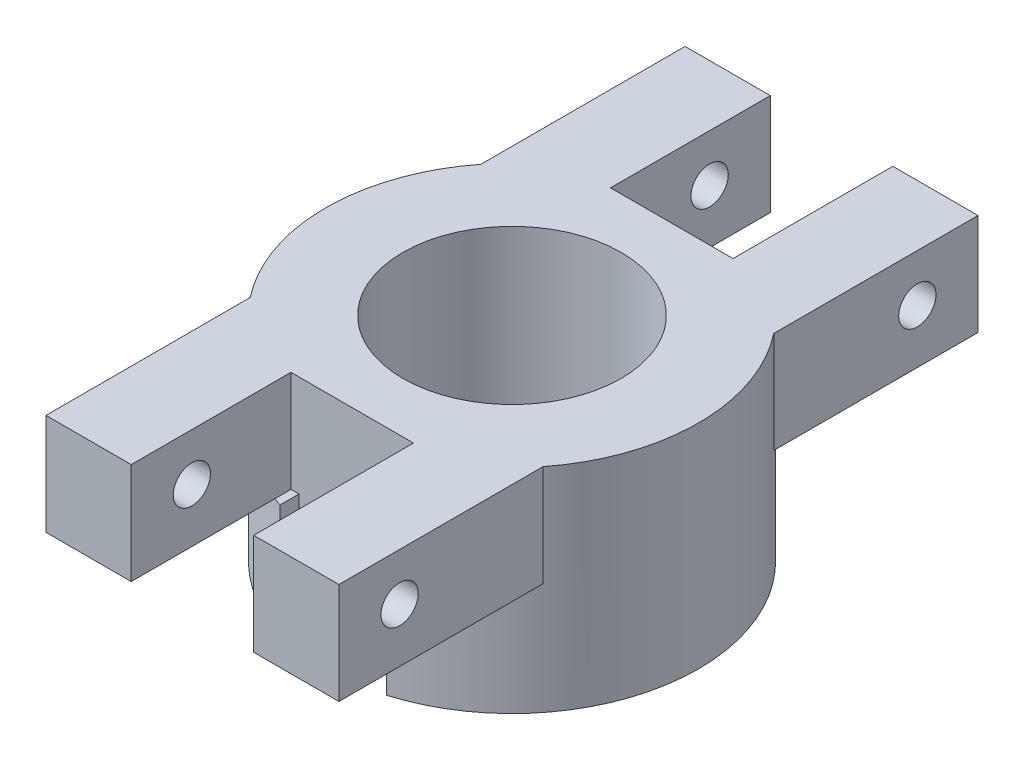
ISO-10303-21;
HEADER;
FILE_DESCRIPTION(('STEP AP214'),'2;1');
FILE_NAME('part.step','',(''),(''),'','','');
FILE_SCHEMA(('AUTOMOTIVE_DESIGN { 1 0 10303 214 1 1 1 1 }'));
ENDSEC;
DATA;
#1=APPLICATION_CONTEXT('core data for automotive mechanical design processes');
#2=APPLICATION_PROTOCOL_DEFINITION('international standard','automotive_design',2000,#1);
#3=PRODUCT_CONTEXT('',#1,'mechanical');
#4=PRODUCT('Part','Part','',(#3));
#5=PRODUCT_RELATED_PRODUCT_CATEGORY('part','',(#4));
#6=PRODUCT_DEFINITION_FORMATION('','',#4);
#7=PRODUCT_DEFINITION_CONTEXT('part definition',#1,'design');
#8=PRODUCT_DEFINITION('design','',#6,#7);
#9=PRODUCT_DEFINITION_SHAPE('','',#8);
#10=(LENGTH_UNIT() NAMED_UNIT(*) SI_UNIT(.MILLI.,.METRE.));
#11=(NAMED_UNIT(*) PLANE_ANGLE_UNIT() SI_UNIT($,.RADIAN.));
#12=(NAMED_UNIT(*) SI_UNIT($,.STERADIAN.) SOLID_ANGLE_UNIT());
#13=UNCERTAINTY_MEASURE_WITH_UNIT(LENGTH_MEASURE(1.E-05),#10,'distance_accuracy_value','');
#14=(GEOMETRIC_REPRESENTATION_CONTEXT(3) GLOBAL_UNCERTAINTY_ASSIGNED_CONTEXT((#13)) GLOBAL_UNIT_ASSIGNED_CONTEXT((#10,
#11,#12)) REPRESENTATION_CONTEXT('',''));
#15=CARTESIAN_POINT('',(0.,0.,0.));
#16=DIRECTION('',(0.,0.,1.));
#17=DIRECTION('',(1.,0.,0.));
#18=AXIS2_PLACEMENT_3D('',#15,#16,#17);
#19=CARTESIAN_POINT('',(0.,5.,0.));
#20=DIRECTION('',(0.,1.,0.));
#21=DIRECTION('',(0.,0.,1.));
#22=AXIS2_PLACEMENT_3D('',#19,#20,#21);
#23=PLANE('',#22);
#24=CARTESIAN_POINT('',(0.,5.,0.));
#25=DIRECTION('',(0.,1.,0.));
#26=DIRECTION('',(0.,0.,1.));
#27=AXIS2_PLACEMENT_3D('',#24,#25,#26);
#28=CIRCLE('',#27,4.1);
#29=CARTESIAN_POINT('',(0.,5.,4.1));
#30=VERTEX_POINT('',#29);
#31=EDGE_CURVE('E408',#30,#30,#28,.T.);
#32=ORIENTED_EDGE('',*,*,#31,.F.);
#33=EDGE_LOOP('',(#32));
#34=FACE_BOUND('',#33,.T.);
#35=DIRECTION('',(-1.,0.,0.));
#36=VECTOR('',#35,1.);
#37=CARTESIAN_POINT('',(-2.,5.,6.));
#38=LINE('',#37,#36);
#39=CARTESIAN_POINT('',(2.3,5.,6.));
#40=VERTEX_POINT('',#39);
#41=CARTESIAN_POINT('',(-2.3,5.,6.));
#42=VERTEX_POINT('',#41);
#43=EDGE_CURVE('E258',#40,#42,#38,.T.);
#44=ORIENTED_EDGE('',*,*,#43,.F.);
#45=DIRECTION('',(0.,0.,1.));
#46=VECTOR('',#45,1.);
#47=CARTESIAN_POINT('',(2.3,5.,6.));
#48=LINE('',#47,#46);
#49=CARTESIAN_POINT('',(2.3,5.,12.));
#50=VERTEX_POINT('',#49);
#51=EDGE_CURVE('E503',#40,#50,#48,.T.);
#52=ORIENTED_EDGE('',*,*,#51,.T.);
#53=DIRECTION('',(1.,0.,0.));
#54=VECTOR('',#53,1.);
#55=CARTESIAN_POINT('',(2.,5.,12.));
#56=LINE('',#55,#54);
#57=CARTESIAN_POINT('',(5.5,5.,12.));
#58=VERTEX_POINT('',#57);
#59=EDGE_CURVE('E296',#50,#58,#56,.T.);
#60=ORIENTED_EDGE('',*,*,#59,.T.);
#61=DIRECTION('',(0.,0.,1.));
#62=VECTOR('',#61,1.);
#63=CARTESIAN_POINT('',(5.5,5.,4.));
#64=LINE('',#63,#62);
#65=CARTESIAN_POINT('',(5.5,5.,4.33012701892219));
#66=VERTEX_POINT('',#65);
#67=EDGE_CURVE('E299',#66,#58,#64,.T.);
#68=ORIENTED_EDGE('',*,*,#67,.F.);
#69=CARTESIAN_POINT('',(0.,5.,0.));
#70=DIRECTION('',(0.,1.,0.));
#71=DIRECTION('',(0.,0.,1.));
#72=AXIS2_PLACEMENT_3D('',#69,#70,#71);
#73=CIRCLE('',#72,7.);
#74=CARTESIAN_POINT('',(5.5,5.,-4.33012701892219));
#75=VERTEX_POINT('',#74);
#76=EDGE_CURVE('E419',#66,#75,#73,.T.);
#77=ORIENTED_EDGE('',*,*,#76,.T.);
#78=DIRECTION('',(0.,0.,-1.));
#79=VECTOR('',#78,1.);
#80=CARTESIAN_POINT('',(5.5,5.,-4.));
#81=LINE('',#80,#79);
#82=CARTESIAN_POINT('',(5.5,5.,-12.));
#83=VERTEX_POINT('',#82);
#84=EDGE_CURVE('E393',#75,#83,#81,.T.);
#85=ORIENTED_EDGE('',*,*,#84,.T.);
#86=DIRECTION('',(1.,0.,0.));
#87=VECTOR('',#86,1.);
#88=CARTESIAN_POINT('',(2.,5.,-12.));
#89=LINE('',#88,#87);
#90=CARTESIAN_POINT('',(2.3,5.,-12.));
#91=VERTEX_POINT('',#90);
#92=EDGE_CURVE('E385',#91,#83,#89,.T.);
#93=ORIENTED_EDGE('',*,*,#92,.F.);
#94=DIRECTION('',(0.,0.,-1.));
#95=VECTOR('',#94,1.);
#96=CARTESIAN_POINT('',(2.3,5.,-6.));
#97=LINE('',#96,#95);
#98=CARTESIAN_POINT('',(2.3,5.,-6.));
#99=VERTEX_POINT('',#98);
#100=EDGE_CURVE('E373',#99,#91,#97,.T.);
#101=ORIENTED_EDGE('',*,*,#100,.F.);
#102=DIRECTION('',(1.,0.,0.));
#103=VECTOR('',#102,1.);
#104=CARTESIAN_POINT('',(2.,5.,-6.));
#105=LINE('',#104,#103);
#106=CARTESIAN_POINT('',(-2.3,5.,-6.));
#107=VERTEX_POINT('',#106);
#108=EDGE_CURVE('E364',#107,#99,#105,.T.);
#109=ORIENTED_EDGE('',*,*,#108,.F.);
#110=DIRECTION('',(0.,0.,-1.));
#111=VECTOR('',#110,1.);
#112=CARTESIAN_POINT('',(-2.3,5.,-6.));
#113=LINE('',#112,#111);
#114=CARTESIAN_POINT('',(-2.3,5.,-12.));
#115=VERTEX_POINT('',#114);
#116=EDGE_CURVE('E333',#107,#115,#113,.T.);
#117=ORIENTED_EDGE('',*,*,#116,.T.);
#118=DIRECTION('',(-1.,0.,0.));
#119=VECTOR('',#118,1.);
#120=CARTESIAN_POINT('',(-2.,5.,-12.));
#121=LINE('',#120,#119);
#122=CARTESIAN_POINT('',(-5.5,5.,-12.));
#123=VERTEX_POINT('',#122);
#124=EDGE_CURVE('E351',#115,#123,#121,.T.);
#125=ORIENTED_EDGE('',*,*,#124,.T.);
#126=DIRECTION('',(0.,0.,-1.));
#127=VECTOR('',#126,1.);
#128=CARTESIAN_POINT('',(-5.5,5.,-4.));
#129=LINE('',#128,#127);
#130=CARTESIAN_POINT('',(-5.5,5.,-4.33012701892219));
#131=VERTEX_POINT('',#130);
#132=EDGE_CURVE('E354',#131,#123,#129,.T.);
#133=ORIENTED_EDGE('',*,*,#132,.F.);
#134=CARTESIAN_POINT('',(-5.5,5.,4.33012701892219));
#135=VERTEX_POINT('',#134);
#136=EDGE_CURVE('E418',#131,#135,#73,.T.);
#137=ORIENTED_EDGE('',*,*,#136,.T.);
#138=DIRECTION('',(0.,0.,1.));
#139=VECTOR('',#138,1.);
#140=CARTESIAN_POINT('',(-5.5,5.,4.));
#141=LINE('',#140,#139);
#142=CARTESIAN_POINT('',(-5.5,5.,12.));
#143=VERTEX_POINT('',#142);
#144=EDGE_CURVE('E285',#135,#143,#141,.T.);
#145=ORIENTED_EDGE('',*,*,#144,.T.);
#146=DIRECTION('',(-1.,0.,0.));
#147=VECTOR('',#146,1.);
#148=CARTESIAN_POINT('',(-2.,5.,12.));
#149=LINE('',#148,#147);
#150=CARTESIAN_POINT('',(-2.3,5.,12.));
#151=VERTEX_POINT('',#150);
#152=EDGE_CURVE('E277',#151,#143,#149,.T.);
#153=ORIENTED_EDGE('',*,*,#152,.F.);
#154=DIRECTION('',(0.,0.,1.));
#155=VECTOR('',#154,1.);
#156=CARTESIAN_POINT('',(-2.3,5.,6.));
#157=LINE('',#156,#155);
#158=EDGE_CURVE('E53',#42,#151,#157,.T.);
#159=ORIENTED_EDGE('',*,*,#158,.F.);
#160=EDGE_LOOP('',(#44,#52,#60,#68,#77,#85,#93,#101,#109,#117,#125,#133,#137,#145,#153,#159));
#161=FACE_BOUND('',#160,.T.);
#162=ADVANCED_FACE('F36',(#34,#161),#23,.T.);
#163=CARTESIAN_POINT('',(2.,5.,4.));
#164=DIRECTION('',(1.,0.,0.));
#165=DIRECTION('',(0.,0.,-1.));
#166=AXIS2_PLACEMENT_3D('',#163,#164,#165);
#167=PLANE('',#166);
#168=DIRECTION('',(0.,0.,1.));
#169=VECTOR('',#168,1.);
#170=CARTESIAN_POINT('',(2.,1.19374248473036,6.));
#171=LINE('',#170,#169);
#172=CARTESIAN_POINT('',(2.,1.19374248473036,6.));
#173=VERTEX_POINT('',#172);
#174=CARTESIAN_POINT('',(2.,1.19374248473036,6.70820393249937));
#175=VERTEX_POINT('',#174);
#176=EDGE_CURVE('E215',#173,#175,#171,.T.);
#177=ORIENTED_EDGE('',*,*,#176,.F.);
#178=DIRECTION('',(0.,-1.,0.));
#179=VECTOR('',#178,1.);
#180=CARTESIAN_POINT('',(2.,5.,6.));
#181=LINE('',#180,#179);
#182=CARTESIAN_POINT('',(2.,-3.,6.));
#183=VERTEX_POINT('',#182);
#184=EDGE_CURVE('E228',#173,#183,#181,.T.);
#185=ORIENTED_EDGE('',*,*,#184,.T.);
#186=DIRECTION('',(0.,0.,1.));
#187=VECTOR('',#186,1.);
#188=CARTESIAN_POINT('',(2.,-3.,6.));
#189=LINE('',#188,#187);
#190=CARTESIAN_POINT('',(2.,-3.,6.70820393249937));
#191=VERTEX_POINT('',#190);
#192=EDGE_CURVE('E243',#183,#191,#189,.T.);
#193=ORIENTED_EDGE('',*,*,#192,.T.);
#194=DIRECTION('',(0.,1.,0.));
#195=VECTOR('',#194,1.);
#196=CARTESIAN_POINT('',(2.,-3.,6.70820393249937));
#197=LINE('',#196,#195);
#198=EDGE_CURVE('E231',#191,#175,#197,.T.);
#199=ORIENTED_EDGE('',*,*,#198,.T.);
#200=EDGE_LOOP('',(#177,#185,#193,#199));
#201=FACE_BOUND('',#200,.T.);
#202=ADVANCED_FACE('F227',(#201),#167,.F.);
#203=CARTESIAN_POINT('',(2.,1.19374248473036,4.));
#204=DIRECTION('',(0.,1.,0.));
#205=DIRECTION('',(-1.,0.,0.));
#206=AXIS2_PLACEMENT_3D('',#203,#204,#205);
#207=PLANE('',#206);
#208=DIRECTION('',(0.,0.,1.));
#209=VECTOR('',#208,1.);
#210=CARTESIAN_POINT('',(2.3,1.19374248473036,6.));
#211=LINE('',#210,#209);
#212=CARTESIAN_POINT('',(2.3,1.19374248473036,6.61135387042624));
#213=VERTEX_POINT('',#212);
#214=CARTESIAN_POINT('',(2.3,1.19374248473036,12.));
#215=VERTEX_POINT('',#214);
#216=EDGE_CURVE('E232',#213,#215,#211,.T.);
#217=ORIENTED_EDGE('',*,*,#216,.F.);
#218=CARTESIAN_POINT('',(0.,1.19374248473036,0.));
#219=DIRECTION('',(0.,1.,0.));
#220=DIRECTION('',(-1.,0.,0.));
#221=AXIS2_PLACEMENT_3D('',#218,#219,#220);
#222=CIRCLE('',#221,7.);
#223=CARTESIAN_POINT('',(5.5,1.19374248473036,4.33012701892219));
#224=VERTEX_POINT('',#223);
#225=EDGE_CURVE('E425',#224,#213,#222,.F.);
#226=ORIENTED_EDGE('',*,*,#225,.F.);
#227=DIRECTION('',(0.,0.,1.));
#228=VECTOR('',#227,1.);
#229=CARTESIAN_POINT('',(5.5,1.19374248473036,4.));
#230=LINE('',#229,#228);
#231=CARTESIAN_POINT('',(5.5,1.19374248473036,12.));
#232=VERTEX_POINT('',#231);
#233=EDGE_CURVE('E298',#224,#232,#230,.T.);
#234=ORIENTED_EDGE('',*,*,#233,.T.);
#235=DIRECTION('',(-1.,0.,0.));
#236=VECTOR('',#235,1.);
#237=CARTESIAN_POINT('',(2.,1.19374248473036,12.));
#238=LINE('',#237,#236);
#239=EDGE_CURVE('E288',#232,#215,#238,.T.);
#240=ORIENTED_EDGE('',*,*,#239,.T.);
#241=EDGE_LOOP('',(#217,#226,#234,#240));
#242=FACE_BOUND('',#241,.T.);
#243=ADVANCED_FACE('F546',(#242),#207,.F.);
#244=CARTESIAN_POINT('',(0.,0.,12.));
#245=DIRECTION('',(0.,0.,-1.));
#246=DIRECTION('',(1.,0.,0.));
#247=AXIS2_PLACEMENT_3D('',#244,#245,#246);
#248=PLANE('',#247);
#249=DIRECTION('',(0.,-1.,0.));
#250=VECTOR('',#249,1.);
#251=CARTESIAN_POINT('',(2.3,5.,12.));
#252=LINE('',#251,#250);
#253=EDGE_CURVE('E223',#50,#215,#252,.T.);
#254=ORIENTED_EDGE('',*,*,#253,.T.);
#255=ORIENTED_EDGE('',*,*,#239,.F.);
#256=DIRECTION('',(0.,-1.,0.));
#257=VECTOR('',#256,1.);
#258=CARTESIAN_POINT('',(5.5,5.,12.));
#259=LINE('',#258,#257);
#260=EDGE_CURVE('E293',#58,#232,#259,.T.);
#261=ORIENTED_EDGE('',*,*,#260,.F.);
#262=ORIENTED_EDGE('',*,*,#59,.F.);
#263=EDGE_LOOP('',(#254,#255,#261,#262));
#264=FACE_BOUND('',#263,.T.);
#265=ADVANCED_FACE('F514',(#264),#248,.F.);
#266=CARTESIAN_POINT('',(-7.,3.21941169873696,9.72178091826237));
#267=DIRECTION('',(1.,0.,0.));
#268=DIRECTION('',(0.,1.,0.));
#269=AXIS2_PLACEMENT_3D('',#266,#267,#268);
#270=CYLINDRICAL_SURFACE('',#269,0.7);
#271=CARTESIAN_POINT('',(5.5,3.21941169873696,9.72178091826237));
#272=DIRECTION('',(-1.,0.,0.));
#273=DIRECTION('',(0.,1.,0.));
#274=AXIS2_PLACEMENT_3D('',#271,#272,#273);
#275=CIRCLE('',#274,0.7);
#276=CARTESIAN_POINT('',(5.5,3.91941169873696,9.72178091826237));
#277=VERTEX_POINT('',#276);
#278=EDGE_CURVE('E249',#277,#277,#275,.T.);
#279=ORIENTED_EDGE('',*,*,#278,.F.);
#280=EDGE_LOOP('',(#279));
#281=FACE_BOUND('',#280,.T.);
#282=CARTESIAN_POINT('',(2.3,3.21941169873696,9.72178091826237));
#283=DIRECTION('',(-1.,0.,0.));
#284=DIRECTION('',(0.,0.,1.));
#285=AXIS2_PLACEMENT_3D('',#282,#283,#284);
#286=CIRCLE('',#285,0.7);
#287=CARTESIAN_POINT('',(2.3,3.21941169873696,10.4217809182624));
#288=VERTEX_POINT('',#287);
#289=EDGE_CURVE('E40',#288,#288,#286,.T.);
#290=ORIENTED_EDGE('',*,*,#289,.T.);
#291=EDGE_LOOP('',(#290));
#292=FACE_BOUND('',#291,.T.);
#293=ADVANCED_FACE('F553',(#281,#292),#270,.F.);
#294=CARTESIAN_POINT('',(0.,-3.,0.));
#295=DIRECTION('',(0.,1.,0.));
#296=DIRECTION('',(0.,0.,1.));
#297=AXIS2_PLACEMENT_3D('',#294,#295,#296);
#298=PLANE('',#297);
#299=CARTESIAN_POINT('',(0.,-3.,0.));
#300=DIRECTION('',(0.,1.,0.));
#301=DIRECTION('',(0.,0.,1.));
#302=AXIS2_PLACEMENT_3D('',#299,#300,#301);
#303=CIRCLE('',#302,4.1);
#304=CARTESIAN_POINT('',(0.,-3.,4.1));
#305=VERTEX_POINT('',#304);
#306=EDGE_CURVE('E409',#305,#305,#303,.T.);
#307=ORIENTED_EDGE('',*,*,#306,.T.);
#308=EDGE_LOOP('',(#307));
#309=FACE_BOUND('',#308,.T.);
#310=ORIENTED_EDGE('',*,*,#192,.F.);
#311=DIRECTION('',(-1.,0.,0.));
#312=VECTOR('',#311,1.);
#313=CARTESIAN_POINT('',(2.,-3.,6.));
#314=LINE('',#313,#312);
#315=CARTESIAN_POINT('',(-2.,-3.,6.));
#316=VERTEX_POINT('',#315);
#317=EDGE_CURVE('E238',#183,#316,#314,.T.);
#318=ORIENTED_EDGE('',*,*,#317,.T.);
#319=DIRECTION('',(0.,0.,1.));
#320=VECTOR('',#319,1.);
#321=CARTESIAN_POINT('',(-2.,-3.,6.));
#322=LINE('',#321,#320);
#323=CARTESIAN_POINT('',(-2.,-3.,6.70820393249937));
#324=VERTEX_POINT('',#323);
#325=EDGE_CURVE('E240',#316,#324,#322,.T.);
#326=ORIENTED_EDGE('',*,*,#325,.T.);
#327=CARTESIAN_POINT('',(0.,-3.,0.));
#328=DIRECTION('',(0.,1.,0.));
#329=DIRECTION('',(0.,0.,1.));
#330=AXIS2_PLACEMENT_3D('',#327,#328,#329);
#331=CIRCLE('',#330,7.);
#332=CARTESIAN_POINT('',(-2.,-3.,-6.70820393249937));
#333=VERTEX_POINT('',#332);
#334=EDGE_CURVE('E421',#333,#324,#331,.T.);
#335=ORIENTED_EDGE('',*,*,#334,.F.);
#336=DIRECTION('',(0.,0.,-1.));
#337=VECTOR('',#336,1.);
#338=CARTESIAN_POINT('',(-2.,-3.,-6.));
#339=LINE('',#338,#337);
#340=CARTESIAN_POINT('',(-2.,-3.,-6.));
#341=VERTEX_POINT('',#340);
#342=EDGE_CURVE('E310',#341,#333,#339,.T.);
#343=ORIENTED_EDGE('',*,*,#342,.F.);
#344=DIRECTION('',(-1.,0.,0.));
#345=VECTOR('',#344,1.);
#346=CARTESIAN_POINT('',(2.,-3.,-6.));
#347=LINE('',#346,#345);
#348=CARTESIAN_POINT('',(2.,-3.,-6.));
#349=VERTEX_POINT('',#348);
#350=EDGE_CURVE('E305',#349,#341,#347,.T.);
#351=ORIENTED_EDGE('',*,*,#350,.F.);
#352=DIRECTION('',(0.,0.,-1.));
#353=VECTOR('',#352,1.);
#354=CARTESIAN_POINT('',(2.,-3.,-6.));
#355=LINE('',#354,#353);
#356=CARTESIAN_POINT('',(2.,-3.,-6.70820393249937));
#357=VERTEX_POINT('',#356);
#358=EDGE_CURVE('E309',#349,#357,#355,.T.);
#359=ORIENTED_EDGE('',*,*,#358,.T.);
#360=EDGE_CURVE('E422',#191,#357,#331,.T.);
#361=ORIENTED_EDGE('',*,*,#360,.F.);
#362=EDGE_LOOP('',(#310,#318,#326,#335,#343,#351,#359,#361));
#363=FACE_BOUND('',#362,.T.);
#364=ADVANCED_FACE('F495',(#309,#363),#298,.F.);
#365=CARTESIAN_POINT('',(0.,-3.,0.));
#366=DIRECTION('',(0.,1.,0.));
#367=DIRECTION('',(0.,0.,1.));
#368=AXIS2_PLACEMENT_3D('',#365,#366,#367);
#369=CYLINDRICAL_SURFACE('',#368,7.);
#370=ORIENTED_EDGE('',*,*,#76,.F.);
#371=DIRECTION('',(0.,1.,0.));
#372=VECTOR('',#371,1.);
#373=CARTESIAN_POINT('',(5.5,-3.,4.33012701892219));
#374=LINE('',#373,#372);
#375=EDGE_CURVE('E61',#66,#224,#374,.F.);
#376=ORIENTED_EDGE('',*,*,#375,.T.);
#377=ORIENTED_EDGE('',*,*,#225,.T.);
#378=CARTESIAN_POINT('',(0.,1.19374248473036,0.));
#379=DIRECTION('',(0.,1.,0.));
#380=DIRECTION('',(0.,0.,1.));
#381=AXIS2_PLACEMENT_3D('',#378,#379,#380);
#382=CIRCLE('',#381,7.);
#383=EDGE_CURVE('E499',#213,#175,#382,.F.);
#384=ORIENTED_EDGE('',*,*,#383,.T.);
#385=ORIENTED_EDGE('',*,*,#198,.F.);
#386=ORIENTED_EDGE('',*,*,#360,.T.);
#387=DIRECTION('',(0.,-1.,0.));
#388=VECTOR('',#387,1.);
#389=CARTESIAN_POINT('',(2.,5.,-6.70820393249937));
#390=LINE('',#389,#388);
#391=CARTESIAN_POINT('',(2.,1.19374248473036,-6.70820393249937));
#392=VERTEX_POINT('',#391);
#393=EDGE_CURVE('E406',#392,#357,#390,.T.);
#394=ORIENTED_EDGE('',*,*,#393,.F.);
#395=CARTESIAN_POINT('',(0.,1.19374248473036,0.));
#396=DIRECTION('',(0.,-1.,0.));
#397=DIRECTION('',(0.,0.,-1.));
#398=AXIS2_PLACEMENT_3D('',#395,#396,#397);
#399=CIRCLE('',#398,7.);
#400=CARTESIAN_POINT('',(2.3,1.19374248473036,-6.61135387042624));
#401=VERTEX_POINT('',#400);
#402=EDGE_CURVE('E377',#401,#392,#399,.F.);
#403=ORIENTED_EDGE('',*,*,#402,.F.);
#404=CARTESIAN_POINT('',(0.,1.19374248473036,0.));
#405=DIRECTION('',(0.,-1.,0.));
#406=DIRECTION('',(1.,0.,0.));
#407=AXIS2_PLACEMENT_3D('',#404,#405,#406);
#408=CIRCLE('',#407,7.);
#409=CARTESIAN_POINT('',(5.5,1.19374248473036,-4.33012701892219));
#410=VERTEX_POINT('',#409);
#411=EDGE_CURVE('E396',#410,#401,#408,.F.);
#412=ORIENTED_EDGE('',*,*,#411,.F.);
#413=DIRECTION('',(0.,1.,0.));
#414=VECTOR('',#413,1.);
#415=CARTESIAN_POINT('',(5.5,-3.,-4.33012701892219));
#416=LINE('',#415,#414);
#417=EDGE_CURVE('E401',#75,#410,#416,.F.);
#418=ORIENTED_EDGE('',*,*,#417,.F.);
#419=EDGE_LOOP('',(#370,#376,#377,#384,#385,#386,#394,#403,#412,#418));
#420=FACE_BOUND('',#419,.T.);
#421=ADVANCED_FACE('F38',(#420),#369,.T.);
#422=CARTESIAN_POINT('',(-2.,1.19374248473036,-4.));
#423=DIRECTION('',(0.,1.,0.));
#424=DIRECTION('',(-1.,0.,0.));
#425=AXIS2_PLACEMENT_3D('',#422,#423,#424);
#426=PLANE('',#425);
#427=DIRECTION('',(0.,0.,-1.));
#428=VECTOR('',#427,1.);
#429=CARTESIAN_POINT('',(-2.3,1.19374248473036,-6.));
#430=LINE('',#429,#428);
#431=CARTESIAN_POINT('',(-2.3,1.19374248473036,-6.61135387042624));
#432=VERTEX_POINT('',#431);
#433=CARTESIAN_POINT('',(-2.3,1.19374248473036,-12.));
#434=VERTEX_POINT('',#433);
#435=EDGE_CURVE('E340',#432,#434,#430,.T.);
#436=ORIENTED_EDGE('',*,*,#435,.F.);
#437=CARTESIAN_POINT('',(0.,1.19374248473036,0.));
#438=DIRECTION('',(0.,1.,0.));
#439=DIRECTION('',(-1.,0.,0.));
#440=AXIS2_PLACEMENT_3D('',#437,#438,#439);
#441=CIRCLE('',#440,7.);
#442=CARTESIAN_POINT('',(-5.5,1.19374248473036,-4.33012701892219));
#443=VERTEX_POINT('',#442);
#444=EDGE_CURVE('E357',#443,#432,#441,.F.);
#445=ORIENTED_EDGE('',*,*,#444,.F.);
#446=DIRECTION('',(0.,0.,-1.));
#447=VECTOR('',#446,1.);
#448=CARTESIAN_POINT('',(-5.5,1.19374248473036,-4.));
#449=LINE('',#448,#447);
#450=CARTESIAN_POINT('',(-5.5,1.19374248473036,-12.));
#451=VERTEX_POINT('',#450);
#452=EDGE_CURVE('E353',#443,#451,#449,.T.);
#453=ORIENTED_EDGE('',*,*,#452,.T.);
#454=DIRECTION('',(1.,0.,0.));
#455=VECTOR('',#454,1.);
#456=CARTESIAN_POINT('',(-2.,1.19374248473036,-12.));
#457=LINE('',#456,#455);
#458=EDGE_CURVE('E345',#451,#434,#457,.T.);
#459=ORIENTED_EDGE('',*,*,#458,.T.);
#460=EDGE_LOOP('',(#436,#445,#453,#459));
#461=FACE_BOUND('',#460,.T.);
#462=ADVANCED_FACE('F473',(#461),#426,.F.);
#463=CARTESIAN_POINT('',(0.,0.,-12.));
#464=DIRECTION('',(0.,0.,1.));
#465=DIRECTION('',(-1.,0.,0.));
#466=AXIS2_PLACEMENT_3D('',#463,#464,#465);
#467=PLANE('',#466);
#468=DIRECTION('',(0.,-1.,0.));
#469=VECTOR('',#468,1.);
#470=CARTESIAN_POINT('',(-2.3,5.,-12.));
#471=LINE('',#470,#469);
#472=EDGE_CURVE('E324',#115,#434,#471,.T.);
#473=ORIENTED_EDGE('',*,*,#472,.T.);
#474=ORIENTED_EDGE('',*,*,#458,.F.);
#475=DIRECTION('',(0.,-1.,0.));
#476=VECTOR('',#475,1.);
#477=CARTESIAN_POINT('',(-5.5,5.,-12.));
#478=LINE('',#477,#476);
#479=EDGE_CURVE('E348',#123,#451,#478,.T.);
#480=ORIENTED_EDGE('',*,*,#479,.F.);
#481=ORIENTED_EDGE('',*,*,#124,.F.);
#482=EDGE_LOOP('',(#473,#474,#480,#481));
#483=FACE_BOUND('',#482,.T.);
#484=ADVANCED_FACE('F475',(#483),#467,.F.);
#485=CARTESIAN_POINT('',(0.,1.19374248473036,0.));
#486=DIRECTION('',(0.,-1.,0.));
#487=DIRECTION('',(1.,0.,0.));
#488=AXIS2_PLACEMENT_3D('',#485,#486,#487);
#489=CIRCLE('',#488,7.);
#490=CARTESIAN_POINT('',(-5.5,1.19374248473036,4.33012701892219));
#491=VERTEX_POINT('',#490);
#492=CARTESIAN_POINT('',(-2.3,1.19374248473036,6.61135387042624));
#493=VERTEX_POINT('',#492);
#494=EDGE_CURVE('E12',#491,#493,#489,.F.);
#495=ORIENTED_EDGE('',*,*,#494,.F.);
#496=DIRECTION('',(0.,1.,0.));
#497=VECTOR('',#496,1.);
#498=CARTESIAN_POINT('',(-5.5,-3.,4.33012701892219));
#499=LINE('',#498,#497);
#500=EDGE_CURVE('E45',#135,#491,#499,.F.);
#501=ORIENTED_EDGE('',*,*,#500,.F.);
#502=ORIENTED_EDGE('',*,*,#136,.F.);
#503=DIRECTION('',(0.,1.,0.));
#504=VECTOR('',#503,1.);
#505=CARTESIAN_POINT('',(-5.5,-3.,-4.33012701892219));
#506=LINE('',#505,#504);
#507=EDGE_CURVE('E361',#131,#443,#506,.F.);
#508=ORIENTED_EDGE('',*,*,#507,.T.);
#509=ORIENTED_EDGE('',*,*,#444,.T.);
#510=CARTESIAN_POINT('',(0.,1.19374248473036,0.));
#511=DIRECTION('',(0.,1.,0.));
#512=DIRECTION('',(0.,0.,1.));
#513=AXIS2_PLACEMENT_3D('',#510,#511,#512);
#514=CIRCLE('',#513,7.);
#515=CARTESIAN_POINT('',(-2.,1.19374248473036,-6.70820393249937));
#516=VERTEX_POINT('',#515);
#517=EDGE_CURVE('E336',#432,#516,#514,.F.);
#518=ORIENTED_EDGE('',*,*,#517,.T.);
#519=DIRECTION('',(0.,-1.,0.));
#520=VECTOR('',#519,1.);
#521=CARTESIAN_POINT('',(-2.,5.,-6.70820393249937));
#522=LINE('',#521,#520);
#523=EDGE_CURVE('E403',#516,#333,#522,.T.);
#524=ORIENTED_EDGE('',*,*,#523,.T.);
#525=ORIENTED_EDGE('',*,*,#334,.T.);
#526=DIRECTION('',(0.,1.,0.));
#527=VECTOR('',#526,1.);
#528=CARTESIAN_POINT('',(-2.,-3.,6.70820393249937));
#529=LINE('',#528,#527);
#530=CARTESIAN_POINT('',(-2.,1.19374248473036,6.70820393249937));
#531=VERTEX_POINT('',#530);
#532=EDGE_CURVE('E415',#324,#531,#529,.T.);
#533=ORIENTED_EDGE('',*,*,#532,.T.);
#534=CARTESIAN_POINT('',(0.,1.19374248473036,0.));
#535=DIRECTION('',(0.,-1.,0.));
#536=DIRECTION('',(0.,0.,-1.));
#537=AXIS2_PLACEMENT_3D('',#534,#535,#536);
#538=CIRCLE('',#537,7.);
#539=EDGE_CURVE('E269',#493,#531,#538,.F.);
#540=ORIENTED_EDGE('',*,*,#539,.F.);
#541=EDGE_LOOP('',(#495,#501,#502,#508,#509,#518,#524,#525,#533,#540));
#542=FACE_BOUND('',#541,.T.);
#543=ADVANCED_FACE('F454',(#542),#369,.T.);
#544=CARTESIAN_POINT('',(0.,-3.,0.));
#545=DIRECTION('',(0.,1.,0.));
#546=DIRECTION('',(0.,0.,1.));
#547=AXIS2_PLACEMENT_3D('',#544,#545,#546);
#548=CYLINDRICAL_SURFACE('',#547,4.1);
#549=ORIENTED_EDGE('',*,*,#31,.T.);
#550=EDGE_LOOP('',(#549));
#551=FACE_BOUND('',#550,.T.);
#552=ORIENTED_EDGE('',*,*,#306,.F.);
#553=EDGE_LOOP('',(#552));
#554=FACE_BOUND('',#553,.T.);
#555=ADVANCED_FACE('F564',(#551,#554),#548,.F.);
#556=CARTESIAN_POINT('',(2.,1.19374248473036,-4.));
#557=DIRECTION('',(0.,-1.,0.));
#558=DIRECTION('',(1.,0.,0.));
#559=AXIS2_PLACEMENT_3D('',#556,#557,#558);
#560=PLANE('',#559);
#561=DIRECTION('',(0.,0.,-1.));
#562=VECTOR('',#561,1.);
#563=CARTESIAN_POINT('',(2.3,1.19374248473036,-6.));
#564=LINE('',#563,#562);
#565=CARTESIAN_POINT('',(2.3,1.19374248473036,-12.));
#566=VERTEX_POINT('',#565);
#567=EDGE_CURVE('E381',#401,#566,#564,.T.);
#568=ORIENTED_EDGE('',*,*,#567,.T.);
#569=DIRECTION('',(-1.,0.,0.));
#570=VECTOR('',#569,1.);
#571=CARTESIAN_POINT('',(2.,1.19374248473036,-12.));
#572=LINE('',#571,#570);
#573=CARTESIAN_POINT('',(5.5,1.19374248473036,-12.));
#574=VERTEX_POINT('',#573);
#575=EDGE_CURVE('E390',#574,#566,#572,.T.);
#576=ORIENTED_EDGE('',*,*,#575,.F.);
#577=DIRECTION('',(0.,0.,-1.));
#578=VECTOR('',#577,1.);
#579=CARTESIAN_POINT('',(5.5,1.19374248473036,-4.));
#580=LINE('',#579,#578);
#581=EDGE_CURVE('E394',#410,#574,#580,.T.);
#582=ORIENTED_EDGE('',*,*,#581,.F.);
#583=ORIENTED_EDGE('',*,*,#411,.T.);
#584=EDGE_LOOP('',(#568,#576,#582,#583));
#585=FACE_BOUND('',#584,.T.);
#586=ADVANCED_FACE('F530',(#585),#560,.T.);
#587=CARTESIAN_POINT('',(5.5,5.,-4.));
#588=DIRECTION('',(1.,0.,0.));
#589=DIRECTION('',(0.,0.,-1.));
#590=AXIS2_PLACEMENT_3D('',#587,#588,#589);
#591=PLANE('',#590);
#592=CARTESIAN_POINT('',(5.5,3.21941169873696,-9.72178091826237));
#593=DIRECTION('',(1.,0.,0.));
#594=DIRECTION('',(0.,1.,0.));
#595=AXIS2_PLACEMENT_3D('',#592,#593,#594);
#596=CIRCLE('',#595,0.7);
#597=CARTESIAN_POINT('',(5.5,3.91941169873696,-9.72178091826237));
#598=VERTEX_POINT('',#597);
#599=EDGE_CURVE('E312',#598,#598,#596,.T.);
#600=ORIENTED_EDGE('',*,*,#599,.F.);
#601=EDGE_LOOP('',(#600));
#602=FACE_BOUND('',#601,.T.);
#603=ORIENTED_EDGE('',*,*,#84,.F.);
#604=ORIENTED_EDGE('',*,*,#417,.T.);
#605=ORIENTED_EDGE('',*,*,#581,.T.);
#606=DIRECTION('',(0.,-1.,0.));
#607=VECTOR('',#606,1.);
#608=CARTESIAN_POINT('',(5.5,5.,-12.));
#609=LINE('',#608,#607);
#610=EDGE_CURVE('E387',#83,#574,#609,.T.);
#611=ORIENTED_EDGE('',*,*,#610,.F.);
#612=EDGE_LOOP('',(#603,#604,#605,#611));
#613=FACE_BOUND('',#612,.T.);
#614=ADVANCED_FACE('F523',(#602,#613),#591,.T.);
#615=CARTESIAN_POINT('',(0.,0.,-12.));
#616=DIRECTION('',(0.,0.,1.));
#617=DIRECTION('',(1.,0.,0.));
#618=AXIS2_PLACEMENT_3D('',#615,#616,#617);
#619=PLANE('',#618);
#620=ORIENTED_EDGE('',*,*,#575,.T.);
#621=DIRECTION('',(0.,-1.,0.));
#622=VECTOR('',#621,1.);
#623=CARTESIAN_POINT('',(2.3,5.,-12.));
#624=LINE('',#623,#622);
#625=EDGE_CURVE('E363',#91,#566,#624,.T.);
#626=ORIENTED_EDGE('',*,*,#625,.F.);
#627=ORIENTED_EDGE('',*,*,#92,.T.);
#628=ORIENTED_EDGE('',*,*,#610,.T.);
#629=EDGE_LOOP('',(#620,#626,#627,#628));
#630=FACE_BOUND('',#629,.T.);
#631=ADVANCED_FACE('F533',(#630),#619,.F.);
#632=CARTESIAN_POINT('',(2.,1.19374248473036,-6.));
#633=DIRECTION('',(0.,-1.,0.));
#634=DIRECTION('',(0.,0.,-1.));
#635=AXIS2_PLACEMENT_3D('',#632,#633,#634);
#636=PLANE('',#635);
#637=ORIENTED_EDGE('',*,*,#402,.T.);
#638=DIRECTION('',(0.,0.,-1.));
#639=VECTOR('',#638,1.);
#640=CARTESIAN_POINT('',(2.,1.19374248473036,-6.));
#641=LINE('',#640,#639);
#642=CARTESIAN_POINT('',(2.,1.19374248473036,-6.));
#643=VERTEX_POINT('',#642);
#644=EDGE_CURVE('E375',#643,#392,#641,.T.);
#645=ORIENTED_EDGE('',*,*,#644,.F.);
#646=DIRECTION('',(-1.,0.,0.));
#647=VECTOR('',#646,1.);
#648=CARTESIAN_POINT('',(2.,1.19374248473036,-6.));
#649=LINE('',#648,#647);
#650=CARTESIAN_POINT('',(2.3,1.19374248473036,-6.));
#651=VERTEX_POINT('',#650);
#652=EDGE_CURVE('E370',#651,#643,#649,.T.);
#653=ORIENTED_EDGE('',*,*,#652,.F.);
#654=EDGE_CURVE('E378',#651,#401,#564,.T.);
#655=ORIENTED_EDGE('',*,*,#654,.T.);
#656=EDGE_LOOP('',(#637,#645,#653,#655));
#657=FACE_BOUND('',#656,.T.);
#658=ADVANCED_FACE('F538',(#657),#636,.F.);
#659=CARTESIAN_POINT('',(2.3,5.,-6.));
#660=DIRECTION('',(1.,0.,0.));
#661=DIRECTION('',(0.,0.,-1.));
#662=AXIS2_PLACEMENT_3D('',#659,#660,#661);
#663=PLANE('',#662);
#664=CARTESIAN_POINT('',(2.3,3.21941169873696,-9.72178091826237));
#665=DIRECTION('',(1.,0.,0.));
#666=DIRECTION('',(0.,0.,-1.));
#667=AXIS2_PLACEMENT_3D('',#664,#665,#666);
#668=CIRCLE('',#667,0.7);
#669=CARTESIAN_POINT('',(2.3,3.21941169873696,-10.4217809182624));
#670=VERTEX_POINT('',#669);
#671=EDGE_CURVE('E321',#670,#670,#668,.T.);
#672=ORIENTED_EDGE('',*,*,#671,.T.);
#673=EDGE_LOOP('',(#672));
#674=FACE_BOUND('',#673,.T.);
#675=ORIENTED_EDGE('',*,*,#625,.T.);
#676=ORIENTED_EDGE('',*,*,#567,.F.);
#677=ORIENTED_EDGE('',*,*,#654,.F.);
#678=DIRECTION('',(0.,-1.,0.));
#679=VECTOR('',#678,1.);
#680=CARTESIAN_POINT('',(2.3,5.,-6.));
#681=LINE('',#680,#679);
#682=EDGE_CURVE('E367',#99,#651,#681,.T.);
#683=ORIENTED_EDGE('',*,*,#682,.F.);
#684=ORIENTED_EDGE('',*,*,#100,.T.);
#685=EDGE_LOOP('',(#675,#676,#677,#683,#684));
#686=FACE_BOUND('',#685,.T.);
#687=ADVANCED_FACE('F536',(#674,#686),#663,.F.);
#688=CARTESIAN_POINT('',(0.,0.,-6.));
#689=DIRECTION('',(0.,0.,1.));
#690=DIRECTION('',(1.,0.,0.));
#691=AXIS2_PLACEMENT_3D('',#688,#689,#690);
#692=PLANE('',#691);
#693=ORIENTED_EDGE('',*,*,#652,.T.);
#694=DIRECTION('',(0.,-1.,0.));
#695=VECTOR('',#694,1.);
#696=CARTESIAN_POINT('',(2.,5.,-6.));
#697=LINE('',#696,#695);
#698=EDGE_CURVE('E302',#643,#349,#697,.T.);
#699=ORIENTED_EDGE('',*,*,#698,.T.);
#700=ORIENTED_EDGE('',*,*,#350,.T.);
#701=DIRECTION('',(0.,1.,0.));
#702=VECTOR('',#701,1.);
#703=CARTESIAN_POINT('',(-2.,-3.,-6.));
#704=LINE('',#703,#702);
#705=CARTESIAN_POINT('',(-2.,1.19374248473036,-6.));
#706=VERTEX_POINT('',#705);
#707=EDGE_CURVE('E307',#341,#706,#704,.T.);
#708=ORIENTED_EDGE('',*,*,#707,.T.);
#709=DIRECTION('',(1.,0.,0.));
#710=VECTOR('',#709,1.);
#711=CARTESIAN_POINT('',(-2.,1.19374248473036,-6.));
#712=LINE('',#711,#710);
#713=CARTESIAN_POINT('',(-2.3,1.19374248473036,-6.));
#714=VERTEX_POINT('',#713);
#715=EDGE_CURVE('E325',#714,#706,#712,.T.);
#716=ORIENTED_EDGE('',*,*,#715,.F.);
#717=DIRECTION('',(0.,-1.,0.));
#718=VECTOR('',#717,1.);
#719=CARTESIAN_POINT('',(-2.3,5.,-6.));
#720=LINE('',#719,#718);
#721=EDGE_CURVE('E328',#107,#714,#720,.T.);
#722=ORIENTED_EDGE('',*,*,#721,.F.);
#723=ORIENTED_EDGE('',*,*,#108,.T.);
#724=ORIENTED_EDGE('',*,*,#682,.T.);
#725=EDGE_LOOP('',(#693,#699,#700,#708,#716,#722,#723,#724));
#726=FACE_BOUND('',#725,.T.);
#727=ADVANCED_FACE('F484',(#726),#692,.F.);
#728=CARTESIAN_POINT('',(-5.5,5.,-4.));
#729=DIRECTION('',(1.,0.,0.));
#730=DIRECTION('',(0.,0.,-1.));
#731=AXIS2_PLACEMENT_3D('',#728,#729,#730);
#732=PLANE('',#731);
#733=CARTESIAN_POINT('',(-5.5,3.21941169873696,-9.72178091826237));
#734=DIRECTION('',(1.,0.,0.));
#735=DIRECTION('',(0.,0.,-1.));
#736=AXIS2_PLACEMENT_3D('',#733,#734,#735);
#737=CIRCLE('',#736,0.7);
#738=CARTESIAN_POINT('',(-5.5,3.21941169873696,-10.4217809182624));
#739=VERTEX_POINT('',#738);
#740=EDGE_CURVE('E318',#739,#739,#737,.T.);
#741=ORIENTED_EDGE('',*,*,#740,.T.);
#742=EDGE_LOOP('',(#741));
#743=FACE_BOUND('',#742,.T.);
#744=ORIENTED_EDGE('',*,*,#507,.F.);
#745=ORIENTED_EDGE('',*,*,#132,.T.);
#746=ORIENTED_EDGE('',*,*,#479,.T.);
#747=ORIENTED_EDGE('',*,*,#452,.F.);
#748=EDGE_LOOP('',(#744,#745,#746,#747));
#749=FACE_BOUND('',#748,.T.);
#750=ADVANCED_FACE('F468',(#743,#749),#732,.F.);
#751=CARTESIAN_POINT('',(-2.3,5.,-6.));
#752=DIRECTION('',(1.,0.,0.));
#753=DIRECTION('',(0.,0.,-1.));
#754=AXIS2_PLACEMENT_3D('',#751,#752,#753);
#755=PLANE('',#754);
#756=CARTESIAN_POINT('',(-2.3,3.21941169873696,-9.72178091826237));
#757=DIRECTION('',(1.,0.,0.));
#758=DIRECTION('',(0.,0.,-1.));
#759=AXIS2_PLACEMENT_3D('',#756,#757,#758);
#760=CIRCLE('',#759,0.7);
#761=CARTESIAN_POINT('',(-2.3,3.21941169873696,-10.4217809182624));
#762=VERTEX_POINT('',#761);
#763=EDGE_CURVE('E317',#762,#762,#760,.T.);
#764=ORIENTED_EDGE('',*,*,#763,.F.);
#765=EDGE_LOOP('',(#764));
#766=FACE_BOUND('',#765,.T.);
#767=ORIENTED_EDGE('',*,*,#472,.F.);
#768=ORIENTED_EDGE('',*,*,#116,.F.);
#769=ORIENTED_EDGE('',*,*,#721,.T.);
#770=EDGE_CURVE('E337',#714,#432,#430,.T.);
#771=ORIENTED_EDGE('',*,*,#770,.T.);
#772=ORIENTED_EDGE('',*,*,#435,.T.);
#773=EDGE_LOOP('',(#767,#768,#769,#771,#772));
#774=FACE_BOUND('',#773,.T.);
#775=ADVANCED_FACE('F479',(#766,#774),#755,.T.);
#776=CARTESIAN_POINT('',(-2.,1.19374248473036,-6.));
#777=DIRECTION('',(0.,1.,0.));
#778=DIRECTION('',(0.,0.,1.));
#779=AXIS2_PLACEMENT_3D('',#776,#777,#778);
#780=PLANE('',#779);
#781=ORIENTED_EDGE('',*,*,#770,.F.);
#782=ORIENTED_EDGE('',*,*,#715,.T.);
#783=DIRECTION('',(0.,0.,-1.));
#784=VECTOR('',#783,1.);
#785=CARTESIAN_POINT('',(-2.,1.19374248473036,-6.));
#786=LINE('',#785,#784);
#787=EDGE_CURVE('E330',#706,#516,#786,.T.);
#788=ORIENTED_EDGE('',*,*,#787,.T.);
#789=ORIENTED_EDGE('',*,*,#517,.F.);
#790=EDGE_LOOP('',(#781,#782,#788,#789));
#791=FACE_BOUND('',#790,.T.);
#792=ADVANCED_FACE('F489',(#791),#780,.T.);
#793=CARTESIAN_POINT('',(-7.,3.21941169873696,-9.72178091826237));
#794=DIRECTION('',(1.,0.,0.));
#795=DIRECTION('',(0.,1.,0.));
#796=AXIS2_PLACEMENT_3D('',#793,#794,#795);
#797=CYLINDRICAL_SURFACE('',#796,0.7);
#798=ORIENTED_EDGE('',*,*,#763,.T.);
#799=EDGE_LOOP('',(#798));
#800=FACE_BOUND('',#799,.T.);
#801=ORIENTED_EDGE('',*,*,#740,.F.);
#802=EDGE_LOOP('',(#801));
#803=FACE_BOUND('',#802,.T.);
#804=ADVANCED_FACE('F615',(#800,#803),#797,.F.);
#805=ORIENTED_EDGE('',*,*,#599,.T.);
#806=EDGE_LOOP('',(#805));
#807=FACE_BOUND('',#806,.T.);
#808=ORIENTED_EDGE('',*,*,#671,.F.);
#809=EDGE_LOOP('',(#808));
#810=FACE_BOUND('',#809,.T.);
#811=ADVANCED_FACE('F611',(#807,#810),#797,.F.);
#812=CARTESIAN_POINT('',(-2.,-3.,-6.));
#813=DIRECTION('',(-1.,0.,0.));
#814=DIRECTION('',(0.,-1.,0.));
#815=AXIS2_PLACEMENT_3D('',#812,#813,#814);
#816=PLANE('',#815);
#817=ORIENTED_EDGE('',*,*,#523,.F.);
#818=ORIENTED_EDGE('',*,*,#787,.F.);
#819=ORIENTED_EDGE('',*,*,#707,.F.);
#820=ORIENTED_EDGE('',*,*,#342,.T.);
#821=EDGE_LOOP('',(#817,#818,#819,#820));
#822=FACE_BOUND('',#821,.T.);
#823=ADVANCED_FACE('F614',(#822),#816,.F.);
#824=CARTESIAN_POINT('',(2.,5.,-6.));
#825=DIRECTION('',(1.,0.,0.));
#826=DIRECTION('',(0.,1.,0.));
#827=AXIS2_PLACEMENT_3D('',#824,#825,#826);
#828=PLANE('',#827);
#829=ORIENTED_EDGE('',*,*,#393,.T.);
#830=ORIENTED_EDGE('',*,*,#358,.F.);
#831=ORIENTED_EDGE('',*,*,#698,.F.);
#832=ORIENTED_EDGE('',*,*,#644,.T.);
#833=EDGE_LOOP('',(#829,#830,#831,#832));
#834=FACE_BOUND('',#833,.T.);
#835=ADVANCED_FACE('F543',(#834),#828,.F.);
#836=CARTESIAN_POINT('',(5.5,5.,4.));
#837=DIRECTION('',(-1.,0.,0.));
#838=DIRECTION('',(0.,0.,1.));
#839=AXIS2_PLACEMENT_3D('',#836,#837,#838);
#840=PLANE('',#839);
#841=ORIENTED_EDGE('',*,*,#278,.T.);
#842=EDGE_LOOP('',(#841));
#843=FACE_BOUND('',#842,.T.);
#844=ORIENTED_EDGE('',*,*,#375,.F.);
#845=ORIENTED_EDGE('',*,*,#67,.T.);
#846=ORIENTED_EDGE('',*,*,#260,.T.);
#847=ORIENTED_EDGE('',*,*,#233,.F.);
#848=EDGE_LOOP('',(#844,#845,#846,#847));
#849=FACE_BOUND('',#848,.T.);
#850=ADVANCED_FACE('F518',(#843,#849),#840,.F.);
#851=CARTESIAN_POINT('',(-2.,1.19374248473036,4.));
#852=DIRECTION('',(0.,-1.,0.));
#853=DIRECTION('',(1.,0.,0.));
#854=AXIS2_PLACEMENT_3D('',#851,#852,#853);
#855=PLANE('',#854);
#856=DIRECTION('',(0.,0.,1.));
#857=VECTOR('',#856,1.);
#858=CARTESIAN_POINT('',(-2.3,1.19374248473036,6.));
#859=LINE('',#858,#857);
#860=CARTESIAN_POINT('',(-2.3,1.19374248473036,12.));
#861=VERTEX_POINT('',#860);
#862=EDGE_CURVE('E273',#493,#861,#859,.T.);
#863=ORIENTED_EDGE('',*,*,#862,.T.);
#864=DIRECTION('',(1.,0.,0.));
#865=VECTOR('',#864,1.);
#866=CARTESIAN_POINT('',(-2.,1.19374248473036,12.));
#867=LINE('',#866,#865);
#868=CARTESIAN_POINT('',(-5.5,1.19374248473036,12.));
#869=VERTEX_POINT('',#868);
#870=EDGE_CURVE('E282',#869,#861,#867,.T.);
#871=ORIENTED_EDGE('',*,*,#870,.F.);
#872=DIRECTION('',(0.,0.,1.));
#873=VECTOR('',#872,1.);
#874=CARTESIAN_POINT('',(-5.5,1.19374248473036,4.));
#875=LINE('',#874,#873);
#876=EDGE_CURVE('E286',#491,#869,#875,.T.);
#877=ORIENTED_EDGE('',*,*,#876,.F.);
#878=ORIENTED_EDGE('',*,*,#494,.T.);
#879=EDGE_LOOP('',(#863,#871,#877,#878));
#880=FACE_BOUND('',#879,.T.);
#881=ADVANCED_FACE('F444',(#880),#855,.T.);
#882=CARTESIAN_POINT('',(-5.5,5.,4.));
#883=DIRECTION('',(-1.,0.,0.));
#884=DIRECTION('',(0.,0.,1.));
#885=AXIS2_PLACEMENT_3D('',#882,#883,#884);
#886=PLANE('',#885);
#887=CARTESIAN_POINT('',(-5.5,3.21941169873696,9.72178091826237));
#888=DIRECTION('',(-1.,0.,0.));
#889=DIRECTION('',(0.,0.,1.));
#890=AXIS2_PLACEMENT_3D('',#887,#888,#889);
#891=CIRCLE('',#890,0.7);
#892=CARTESIAN_POINT('',(-5.5,3.21941169873696,10.4217809182624));
#893=VERTEX_POINT('',#892);
#894=EDGE_CURVE('E254',#893,#893,#891,.F.);
#895=ORIENTED_EDGE('',*,*,#894,.T.);
#896=EDGE_LOOP('',(#895));
#897=FACE_BOUND('',#896,.T.);
#898=ORIENTED_EDGE('',*,*,#144,.F.);
#899=ORIENTED_EDGE('',*,*,#500,.T.);
#900=ORIENTED_EDGE('',*,*,#876,.T.);
#901=DIRECTION('',(0.,-1.,0.));
#902=VECTOR('',#901,1.);
#903=CARTESIAN_POINT('',(-5.5,5.,12.));
#904=LINE('',#903,#902);
#905=EDGE_CURVE('E279',#143,#869,#904,.T.);
#906=ORIENTED_EDGE('',*,*,#905,.F.);
#907=EDGE_LOOP('',(#898,#899,#900,#906));
#908=FACE_BOUND('',#907,.T.);
#909=ADVANCED_FACE('F450',(#897,#908),#886,.T.);
#910=CARTESIAN_POINT('',(0.,0.,12.));
#911=DIRECTION('',(0.,0.,-1.));
#912=DIRECTION('',(-1.,0.,0.));
#913=AXIS2_PLACEMENT_3D('',#910,#911,#912);
#914=PLANE('',#913);
#915=ORIENTED_EDGE('',*,*,#870,.T.);
#916=DIRECTION('',(0.,-1.,0.));
#917=VECTOR('',#916,1.);
#918=CARTESIAN_POINT('',(-2.3,5.,12.));
#919=LINE('',#918,#917);
#920=EDGE_CURVE('E257',#151,#861,#919,.T.);
#921=ORIENTED_EDGE('',*,*,#920,.F.);
#922=ORIENTED_EDGE('',*,*,#152,.T.);
#923=ORIENTED_EDGE('',*,*,#905,.T.);
#924=EDGE_LOOP('',(#915,#921,#922,#923));
#925=FACE_BOUND('',#924,.T.);
#926=ADVANCED_FACE('F447',(#925),#914,.F.);
#927=CARTESIAN_POINT('',(-2.,1.19374248473036,6.));
#928=DIRECTION('',(0.,-1.,0.));
#929=DIRECTION('',(0.,0.,-1.));
#930=AXIS2_PLACEMENT_3D('',#927,#928,#929);
#931=PLANE('',#930);
#932=ORIENTED_EDGE('',*,*,#539,.T.);
#933=DIRECTION('',(0.,0.,1.));
#934=VECTOR('',#933,1.);
#935=CARTESIAN_POINT('',(-2.,1.19374248473036,6.));
#936=LINE('',#935,#934);
#937=CARTESIAN_POINT('',(-2.,1.19374248473036,6.));
#938=VERTEX_POINT('',#937);
#939=EDGE_CURVE('E267',#938,#531,#936,.T.);
#940=ORIENTED_EDGE('',*,*,#939,.F.);
#941=DIRECTION('',(1.,0.,0.));
#942=VECTOR('',#941,1.);
#943=CARTESIAN_POINT('',(-2.,1.19374248473036,6.));
#944=LINE('',#943,#942);
#945=CARTESIAN_POINT('',(-2.3,1.19374248473036,6.));
#946=VERTEX_POINT('',#945);
#947=EDGE_CURVE('E264',#946,#938,#944,.T.);
#948=ORIENTED_EDGE('',*,*,#947,.F.);
#949=EDGE_CURVE('E270',#946,#493,#859,.T.);
#950=ORIENTED_EDGE('',*,*,#949,.T.);
#951=EDGE_LOOP('',(#932,#940,#948,#950));
#952=FACE_BOUND('',#951,.T.);
#953=ADVANCED_FACE('F437',(#952),#931,.F.);
#954=CARTESIAN_POINT('',(-2.3,5.,6.));
#955=DIRECTION('',(-1.,0.,0.));
#956=DIRECTION('',(0.,0.,1.));
#957=AXIS2_PLACEMENT_3D('',#954,#955,#956);
#958=PLANE('',#957);
#959=CARTESIAN_POINT('',(-2.3,3.21941169873696,9.72178091826237));
#960=DIRECTION('',(-1.,0.,0.));
#961=DIRECTION('',(0.,0.,1.));
#962=AXIS2_PLACEMENT_3D('',#959,#960,#961);
#963=CIRCLE('',#962,0.7);
#964=CARTESIAN_POINT('',(-2.3,3.21941169873696,10.4217809182624));
#965=VERTEX_POINT('',#964);
#966=EDGE_CURVE('E253',#965,#965,#963,.F.);
#967=ORIENTED_EDGE('',*,*,#966,.F.);
#968=EDGE_LOOP('',(#967));
#969=FACE_BOUND('',#968,.T.);
#970=ORIENTED_EDGE('',*,*,#920,.T.);
#971=ORIENTED_EDGE('',*,*,#862,.F.);
#972=ORIENTED_EDGE('',*,*,#949,.F.);
#973=DIRECTION('',(0.,-1.,0.));
#974=VECTOR('',#973,1.);
#975=CARTESIAN_POINT('',(-2.3,5.,6.));
#976=LINE('',#975,#974);
#977=EDGE_CURVE('E261',#42,#946,#976,.T.);
#978=ORIENTED_EDGE('',*,*,#977,.F.);
#979=ORIENTED_EDGE('',*,*,#158,.T.);
#980=EDGE_LOOP('',(#970,#971,#972,#978,#979));
#981=FACE_BOUND('',#980,.T.);
#982=ADVANCED_FACE('F435',(#969,#981),#958,.F.);
#983=CARTESIAN_POINT('',(0.,0.,6.));
#984=DIRECTION('',(0.,0.,-1.));
#985=DIRECTION('',(-1.,0.,0.));
#986=AXIS2_PLACEMENT_3D('',#983,#984,#985);
#987=PLANE('',#986);
#988=ORIENTED_EDGE('',*,*,#947,.T.);
#989=DIRECTION('',(0.,1.,0.));
#990=VECTOR('',#989,1.);
#991=CARTESIAN_POINT('',(-2.,-3.,6.));
#992=LINE('',#991,#990);
#993=EDGE_CURVE('E245',#316,#938,#992,.T.);
#994=ORIENTED_EDGE('',*,*,#993,.F.);
#995=ORIENTED_EDGE('',*,*,#317,.F.);
#996=ORIENTED_EDGE('',*,*,#184,.F.);
#997=DIRECTION('',(-1.,0.,0.));
#998=VECTOR('',#997,1.);
#999=CARTESIAN_POINT('',(2.,1.19374248473036,6.));
#1000=LINE('',#999,#998);
#1001=CARTESIAN_POINT('',(2.3,1.19374248473036,6.));
#1002=VERTEX_POINT('',#1001);
#1003=EDGE_CURVE('E212',#1002,#173,#1000,.T.);
#1004=ORIENTED_EDGE('',*,*,#1003,.F.);
#1005=DIRECTION('',(0.,-1.,0.));
#1006=VECTOR('',#1005,1.);
#1007=CARTESIAN_POINT('',(2.3,5.,6.));
#1008=LINE('',#1007,#1006);
#1009=EDGE_CURVE('E222',#40,#1002,#1008,.T.);
#1010=ORIENTED_EDGE('',*,*,#1009,.F.);
#1011=ORIENTED_EDGE('',*,*,#43,.T.);
#1012=ORIENTED_EDGE('',*,*,#977,.T.);
#1013=EDGE_LOOP('',(#988,#994,#995,#996,#1004,#1010,#1011,#1012));
#1014=FACE_BOUND('',#1013,.T.);
#1015=ADVANCED_FACE('F235',(#1014),#987,.F.);
#1016=ORIENTED_EDGE('',*,*,#894,.F.);
#1017=EDGE_LOOP('',(#1016));
#1018=FACE_BOUND('',#1017,.T.);
#1019=ORIENTED_EDGE('',*,*,#966,.T.);
#1020=EDGE_LOOP('',(#1019));
#1021=FACE_BOUND('',#1020,.T.);
#1022=ADVANCED_FACE('F433',(#1018,#1021),#270,.F.);
#1023=CARTESIAN_POINT('',(-2.,-3.,6.));
#1024=DIRECTION('',(1.,0.,0.));
#1025=DIRECTION('',(0.,1.,0.));
#1026=AXIS2_PLACEMENT_3D('',#1023,#1024,#1025);
#1027=PLANE('',#1026);
#1028=ORIENTED_EDGE('',*,*,#325,.F.);
#1029=ORIENTED_EDGE('',*,*,#993,.T.);
#1030=ORIENTED_EDGE('',*,*,#939,.T.);
#1031=ORIENTED_EDGE('',*,*,#532,.F.);
#1032=EDGE_LOOP('',(#1028,#1029,#1030,#1031));
#1033=FACE_BOUND('',#1032,.T.);
#1034=ADVANCED_FACE('F498',(#1033),#1027,.T.);
#1035=CARTESIAN_POINT('',(2.3,5.,6.));
#1036=DIRECTION('',(-1.,0.,0.));
#1037=DIRECTION('',(0.,0.,1.));
#1038=AXIS2_PLACEMENT_3D('',#1035,#1036,#1037);
#1039=PLANE('',#1038);
#1040=ORIENTED_EDGE('',*,*,#289,.F.);
#1041=EDGE_LOOP('',(#1040));
#1042=FACE_BOUND('',#1041,.T.);
#1043=ORIENTED_EDGE('',*,*,#253,.F.);
#1044=ORIENTED_EDGE('',*,*,#51,.F.);
#1045=ORIENTED_EDGE('',*,*,#1009,.T.);
#1046=EDGE_CURVE('E218',#1002,#213,#211,.T.);
#1047=ORIENTED_EDGE('',*,*,#1046,.T.);
#1048=ORIENTED_EDGE('',*,*,#216,.T.);
#1049=EDGE_LOOP('',(#1043,#1044,#1045,#1047,#1048));
#1050=FACE_BOUND('',#1049,.T.);
#1051=ADVANCED_FACE('F508',(#1042,#1050),#1039,.T.);
#1052=CARTESIAN_POINT('',(2.,1.19374248473036,6.));
#1053=DIRECTION('',(0.,1.,0.));
#1054=DIRECTION('',(0.,0.,1.));
#1055=AXIS2_PLACEMENT_3D('',#1052,#1053,#1054);
#1056=PLANE('',#1055);
#1057=ORIENTED_EDGE('',*,*,#1046,.F.);
#1058=ORIENTED_EDGE('',*,*,#1003,.T.);
#1059=ORIENTED_EDGE('',*,*,#176,.T.);
#1060=ORIENTED_EDGE('',*,*,#383,.F.);
#1061=EDGE_LOOP('',(#1057,#1058,#1059,#1060));
#1062=FACE_BOUND('',#1061,.T.);
#1063=ADVANCED_FACE('F214',(#1062),#1056,.T.);
#1064=CLOSED_SHELL('',(#162,#202,#243,#265,#293,#364,#421,#462,#484,#543,#555,#586,#614,#631,
#658,#687,#727,#750,#775,#792,#804,#811,#823,#835,#850,#881,#909,#926,#953,#982,#1015,#1022,
#1034,#1051,#1063));
#1065=MANIFOLD_SOLID_BREP('B2',#1064);
#1066=ADVANCED_BREP_SHAPE_REPRESENTATION('',(#18,#1065),#14);
#1067=SHAPE_DEFINITION_REPRESENTATION(#9,#1066);
ENDSEC;
END-ISO-10303-21;
